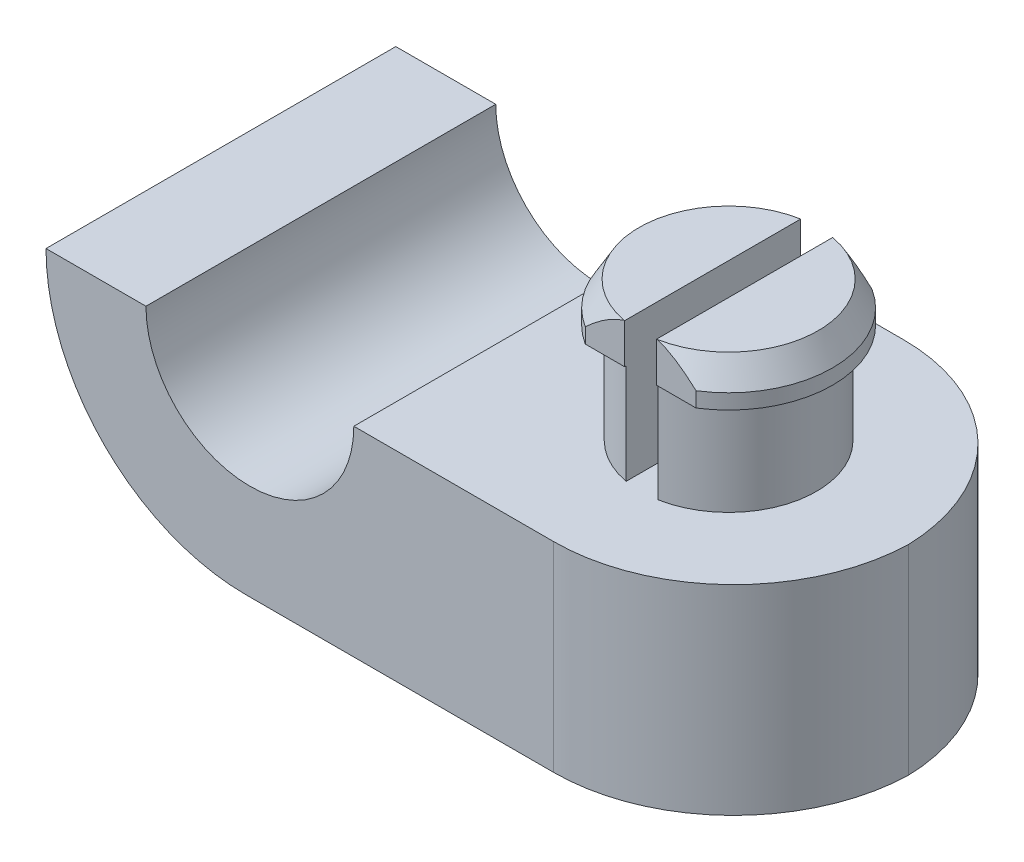
ISO-10303-21;
HEADER;
FILE_DESCRIPTION(('STEP AP214'),'2;1');
FILE_NAME('part.step','',(''),(''),'','','');
FILE_SCHEMA(('AUTOMOTIVE_DESIGN { 1 0 10303 214 1 1 1 1 }'));
ENDSEC;
DATA;
#1=APPLICATION_CONTEXT('core data for automotive mechanical design processes');
#2=APPLICATION_PROTOCOL_DEFINITION('international standard','automotive_design',2000,#1);
#3=PRODUCT_CONTEXT('',#1,'mechanical');
#4=PRODUCT('Part','Part','',(#3));
#5=PRODUCT_RELATED_PRODUCT_CATEGORY('part','',(#4));
#6=PRODUCT_DEFINITION_FORMATION('','',#4);
#7=PRODUCT_DEFINITION_CONTEXT('part definition',#1,'design');
#8=PRODUCT_DEFINITION('design','',#6,#7);
#9=PRODUCT_DEFINITION_SHAPE('','',#8);
#10=(LENGTH_UNIT() NAMED_UNIT(*) SI_UNIT(.MILLI.,.METRE.));
#11=(NAMED_UNIT(*) PLANE_ANGLE_UNIT() SI_UNIT($,.RADIAN.));
#12=(NAMED_UNIT(*) SI_UNIT($,.STERADIAN.) SOLID_ANGLE_UNIT());
#13=UNCERTAINTY_MEASURE_WITH_UNIT(LENGTH_MEASURE(1.E-05),#10,'distance_accuracy_value','');
#14=(GEOMETRIC_REPRESENTATION_CONTEXT(3) GLOBAL_UNCERTAINTY_ASSIGNED_CONTEXT((#13)) GLOBAL_UNIT_ASSIGNED_CONTEXT((#10,
#11,#12)) REPRESENTATION_CONTEXT('',''));
#15=CARTESIAN_POINT('',(0.,0.,0.));
#16=DIRECTION('',(0.,0.,1.));
#17=DIRECTION('',(1.,0.,0.));
#18=AXIS2_PLACEMENT_3D('',#15,#16,#17);
#19=CARTESIAN_POINT('',(9.652,3.175,5.55625));
#20=DIRECTION('',(0.,-1.,0.));
#21=DIRECTION('',(0.,0.,-1.));
#22=AXIS2_PLACEMENT_3D('',#19,#20,#21);
#23=CYLINDRICAL_SURFACE('',#22,2.794);
#24=DIRECTION('',(0.,-1.,0.));
#25=VECTOR('',#24,1.);
#26=CARTESIAN_POINT('',(9.144,3.175,8.30368007190356));
#27=LINE('',#26,#25);
#28=CARTESIAN_POINT('',(9.144,3.175,8.30368007190356));
#29=VERTEX_POINT('',#28);
#30=CARTESIAN_POINT('',(9.144,0.,8.30368007190356));
#31=VERTEX_POINT('',#30);
#32=EDGE_CURVE('E231',#29,#31,#27,.T.);
#33=ORIENTED_EDGE('',*,*,#32,.F.);
#34=CARTESIAN_POINT('',(9.652,3.175,5.55625));
#35=DIRECTION('',(0.,1.,0.));
#36=DIRECTION('',(0.,0.,1.));
#37=AXIS2_PLACEMENT_3D('',#34,#35,#36);
#38=CIRCLE('',#37,2.794);
#39=CARTESIAN_POINT('',(9.144,3.175,2.80881992809644));
#40=VERTEX_POINT('',#39);
#41=EDGE_CURVE('E260',#40,#29,#38,.T.);
#42=ORIENTED_EDGE('',*,*,#41,.F.);
#43=DIRECTION('',(0.,-1.,0.));
#44=VECTOR('',#43,1.);
#45=CARTESIAN_POINT('',(9.144,3.175,2.80881992809644));
#46=LINE('',#45,#44);
#47=CARTESIAN_POINT('',(9.144,0.,2.80881992809644));
#48=VERTEX_POINT('',#47);
#49=EDGE_CURVE('E226',#48,#40,#46,.F.);
#50=ORIENTED_EDGE('',*,*,#49,.F.);
#51=CARTESIAN_POINT('',(9.652,0.,5.55625));
#52=DIRECTION('',(0.,1.,0.));
#53=DIRECTION('',(0.,0.,1.));
#54=AXIS2_PLACEMENT_3D('',#51,#52,#53);
#55=CIRCLE('',#54,2.794);
#56=EDGE_CURVE('E255',#48,#31,#55,.T.);
#57=ORIENTED_EDGE('',*,*,#56,.T.);
#58=EDGE_LOOP('',(#33,#42,#50,#57));
#59=FACE_BOUND('',#58,.T.);
#60=ADVANCED_FACE('F35',(#59),#23,.T.);
#61=DIRECTION('',(0.,-1.,0.));
#62=VECTOR('',#61,1.);
#63=CARTESIAN_POINT('',(10.16,3.175,2.80881992809644));
#64=LINE('',#63,#62);
#65=CARTESIAN_POINT('',(10.16,3.175,2.80881992809644));
#66=VERTEX_POINT('',#65);
#67=CARTESIAN_POINT('',(10.16,0.,2.80881992809644));
#68=VERTEX_POINT('',#67);
#69=EDGE_CURVE('E211',#66,#68,#64,.T.);
#70=ORIENTED_EDGE('',*,*,#69,.F.);
#71=CARTESIAN_POINT('',(10.16,3.175,8.30368007190356));
#72=VERTEX_POINT('',#71);
#73=EDGE_CURVE('E256',#72,#66,#38,.T.);
#74=ORIENTED_EDGE('',*,*,#73,.F.);
#75=DIRECTION('',(0.,-1.,0.));
#76=VECTOR('',#75,1.);
#77=CARTESIAN_POINT('',(10.16,3.175,8.30368007190356));
#78=LINE('',#77,#76);
#79=CARTESIAN_POINT('',(10.16,0.,8.30368007190356));
#80=VERTEX_POINT('',#79);
#81=EDGE_CURVE('E220',#80,#72,#78,.F.);
#82=ORIENTED_EDGE('',*,*,#81,.F.);
#83=EDGE_CURVE('E261',#80,#68,#55,.T.);
#84=ORIENTED_EDGE('',*,*,#83,.T.);
#85=EDGE_LOOP('',(#70,#74,#82,#84));
#86=FACE_BOUND('',#85,.T.);
#87=ADVANCED_FACE('F381',(#86),#23,.T.);
#88=CARTESIAN_POINT('',(9.652,3.175,5.55625));
#89=DIRECTION('',(0.,1.,0.));
#90=DIRECTION('',(0.,0.,1.));
#91=AXIS2_PLACEMENT_3D('',#88,#89,#90);
#92=PLANE('',#91);
#93=DIRECTION('',(0.,0.,1.));
#94=VECTOR('',#93,1.);
#95=CARTESIAN_POINT('',(10.16,3.175,5.55625));
#96=LINE('',#95,#94);
#97=CARTESIAN_POINT('',(10.16,3.175,2.76225));
#98=VERTEX_POINT('',#97);
#99=EDGE_CURVE('E208',#98,#66,#96,.T.);
#100=ORIENTED_EDGE('',*,*,#99,.F.);
#101=DIRECTION('',(-1.,0.,0.));
#102=VECTOR('',#101,1.);
#103=CARTESIAN_POINT('',(7.89223637951002,3.175,2.76225));
#104=LINE('',#103,#102);
#105=CARTESIAN_POINT('',(11.41176362049,3.175,2.76225));
#106=VERTEX_POINT('',#105);
#107=EDGE_CURVE('E207',#106,#98,#104,.T.);
#108=ORIENTED_EDGE('',*,*,#107,.F.);
#109=CARTESIAN_POINT('',(9.652,3.175,5.55625));
#110=DIRECTION('',(0.,1.,0.));
#111=DIRECTION('',(0.,0.,1.));
#112=AXIS2_PLACEMENT_3D('',#109,#110,#111);
#113=CIRCLE('',#112,3.302);
#114=CARTESIAN_POINT('',(11.41176362049,3.175,8.35025));
#115=VERTEX_POINT('',#114);
#116=EDGE_CURVE('E243',#115,#106,#113,.T.);
#117=ORIENTED_EDGE('',*,*,#116,.F.);
#118=DIRECTION('',(1.,0.,0.));
#119=VECTOR('',#118,1.);
#120=CARTESIAN_POINT('',(7.89223637951002,3.175,8.35025));
#121=LINE('',#120,#119);
#122=CARTESIAN_POINT('',(10.16,3.175,8.35025));
#123=VERTEX_POINT('',#122);
#124=EDGE_CURVE('E239',#123,#115,#121,.T.);
#125=ORIENTED_EDGE('',*,*,#124,.F.);
#126=EDGE_CURVE('E213',#72,#123,#96,.T.);
#127=ORIENTED_EDGE('',*,*,#126,.F.);
#128=ORIENTED_EDGE('',*,*,#73,.T.);
#129=EDGE_LOOP('',(#100,#108,#117,#125,#127,#128));
#130=FACE_BOUND('',#129,.T.);
#131=ADVANCED_FACE('F336',(#130),#92,.F.);
#132=DIRECTION('',(0.,0.,-1.));
#133=VECTOR('',#132,1.);
#134=CARTESIAN_POINT('',(9.144,3.175,5.55625));
#135=LINE('',#134,#133);
#136=CARTESIAN_POINT('',(9.144,3.175,8.35025));
#137=VERTEX_POINT('',#136);
#138=EDGE_CURVE('E227',#137,#29,#135,.T.);
#139=ORIENTED_EDGE('',*,*,#138,.F.);
#140=CARTESIAN_POINT('',(7.89223637951002,3.175,8.35025));
#141=VERTEX_POINT('',#140);
#142=EDGE_CURVE('E240',#141,#137,#121,.T.);
#143=ORIENTED_EDGE('',*,*,#142,.F.);
#144=CARTESIAN_POINT('',(9.652,3.175,5.55625));
#145=DIRECTION('',(0.,1.,0.));
#146=DIRECTION('',(0.,0.,1.));
#147=AXIS2_PLACEMENT_3D('',#144,#145,#146);
#148=CIRCLE('',#147,3.302);
#149=CARTESIAN_POINT('',(7.89223637951002,3.175,2.76225));
#150=VERTEX_POINT('',#149);
#151=EDGE_CURVE('E233',#150,#141,#148,.T.);
#152=ORIENTED_EDGE('',*,*,#151,.F.);
#153=CARTESIAN_POINT('',(9.144,3.175,2.76225));
#154=VERTEX_POINT('',#153);
#155=EDGE_CURVE('E246',#154,#150,#104,.T.);
#156=ORIENTED_EDGE('',*,*,#155,.F.);
#157=EDGE_CURVE('E224',#40,#154,#135,.T.);
#158=ORIENTED_EDGE('',*,*,#157,.F.);
#159=ORIENTED_EDGE('',*,*,#41,.T.);
#160=EDGE_LOOP('',(#139,#143,#152,#156,#158,#159));
#161=FACE_BOUND('',#160,.T.);
#162=ADVANCED_FACE('F349',(#161),#92,.F.);
#163=CARTESIAN_POINT('',(7.89223637951002,4.445,8.35025));
#164=DIRECTION('',(0.,0.,-1.));
#165=DIRECTION('',(-1.,0.,0.));
#166=AXIS2_PLACEMENT_3D('',#163,#164,#165);
#167=PLANE('',#166);
#168=DIRECTION('',(1.,0.,0.));
#169=VECTOR('',#168,1.);
#170=CARTESIAN_POINT('',(7.89223637951002,4.445,8.35025));
#171=LINE('',#170,#169);
#172=CARTESIAN_POINT('',(9.12251514562598,4.445,8.35025));
#173=VERTEX_POINT('',#172);
#174=CARTESIAN_POINT('',(9.144,4.445,8.35025));
#175=VERTEX_POINT('',#174);
#176=EDGE_CURVE('E234',#173,#175,#171,.T.);
#177=ORIENTED_EDGE('',*,*,#176,.F.);
#178=CARTESIAN_POINT('',(9.12251514562599,4.445,8.35025));
#179=CARTESIAN_POINT('',(9.04475929325533,4.41990563455317,8.35025));
#180=CARTESIAN_POINT('',(8.96873666780904,4.39007238997305,8.35025));
#181=CARTESIAN_POINT('',(8.82040231472255,4.32284826987968,8.35025));
#182=CARTESIAN_POINT('',(8.74807841198133,4.28548450071081,8.35025));
#183=CARTESIAN_POINT('',(8.60770768822331,4.20541355427589,8.35025));
#184=CARTESIAN_POINT('',(8.53961909929552,4.16277800900343,8.35025));
#185=CARTESIAN_POINT('',(8.40638043302648,4.07305674868423,8.35025));
#186=CARTESIAN_POINT('',(8.34123281275837,4.02596741070956,8.35025));
#187=CARTESIAN_POINT('',(8.21079776816959,3.92624191278314,8.35025));
#188=CARTESIAN_POINT('',(8.14562796166965,3.87345346010828,8.35025));
#189=CARTESIAN_POINT('',(8.01735170560367,3.76457083678296,8.35025));
#190=CARTESIAN_POINT('',(7.95426192373615,3.70845696037162,8.35025));
#191=CARTESIAN_POINT('',(7.89223637951002,3.65124999999999,8.35025));
#192=B_SPLINE_CURVE_WITH_KNOTS('',3,(#178,#179,#180,#181,#182,#183,#184,#185,#186,#187,#188,
#189,#190,#191),.UNSPECIFIED.,.F.,.F.,(4,2,2,2,2,2,4),(0.,0.244681358968621,0.488497223943545,
0.729304216410352,0.970308805679508,1.22181555042136,1.47500034036548),.UNSPECIFIED.);
#193=CARTESIAN_POINT('',(7.89223637951002,3.65124999999999,8.35025));
#194=VERTEX_POINT('',#193);
#195=EDGE_CURVE('E62',#173,#194,#192,.T.);
#196=ORIENTED_EDGE('',*,*,#195,.T.);
#197=DIRECTION('',(0.,-1.,0.));
#198=VECTOR('',#197,1.);
#199=CARTESIAN_POINT('',(7.89223637951002,4.445,8.35025));
#200=LINE('',#199,#198);
#201=EDGE_CURVE('E253',#194,#141,#200,.T.);
#202=ORIENTED_EDGE('',*,*,#201,.T.);
#203=ORIENTED_EDGE('',*,*,#142,.T.);
#204=DIRECTION('',(0.,-1.,0.));
#205=VECTOR('',#204,1.);
#206=CARTESIAN_POINT('',(9.144,4.445,8.35025));
#207=LINE('',#206,#205);
#208=EDGE_CURVE('E229',#175,#137,#207,.T.);
#209=ORIENTED_EDGE('',*,*,#208,.F.);
#210=EDGE_LOOP('',(#177,#196,#202,#203,#209));
#211=FACE_BOUND('',#210,.T.);
#212=ADVANCED_FACE('F345',(#211),#167,.F.);
#213=DIRECTION('',(0.,-1.,0.));
#214=VECTOR('',#213,1.);
#215=CARTESIAN_POINT('',(11.41176362049,4.445,8.35025));
#216=LINE('',#215,#214);
#217=CARTESIAN_POINT('',(11.41176362049,3.65124999999999,8.35025));
#218=VERTEX_POINT('',#217);
#219=EDGE_CURVE('E251',#218,#115,#216,.T.);
#220=ORIENTED_EDGE('',*,*,#219,.F.);
#221=CARTESIAN_POINT('',(11.41176362049,3.65124999999999,8.35025));
#222=CARTESIAN_POINT('',(11.3408351929134,3.71663889948708,8.35025));
#223=CARTESIAN_POINT('',(11.2685168144737,3.78063807281625,8.35025));
#224=CARTESIAN_POINT('',(11.12013565491,3.90489820889516,8.35025));
#225=CARTESIAN_POINT('',(11.0440559546576,3.96513887325871,8.35025));
#226=CARTESIAN_POINT('',(10.8896533873198,4.07894027896918,8.35025));
#227=CARTESIAN_POINT('',(10.8114203294183,4.13262139551544,8.35025));
#228=CARTESIAN_POINT('',(10.6506925115505,4.23291033743425,8.35025));
#229=CARTESIAN_POINT('',(10.5682075739385,4.27953356507681,8.35025));
#230=CARTESIAN_POINT('',(10.4347432506512,4.34545760821125,8.35025));
#231=CARTESIAN_POINT('',(10.3853335911521,4.3679297139674,8.35025));
#232=CARTESIAN_POINT('',(10.2846983490377,4.40933162480823,8.35025));
#233=CARTESIAN_POINT('',(10.2334633733887,4.42823849690594,8.35025));
#234=CARTESIAN_POINT('',(10.181484854374,4.445,8.35025));
#235=B_SPLINE_CURVE_WITH_KNOTS('',3,(#221,#222,#223,#224,#225,#226,#227,#228,#229,#230,#231,
#232,#233,#234),.UNSPECIFIED.,.F.,.F.,(4,2,2,2,2,2,4),(0.,0.289514113222375,0.580476283289387,
0.864849650662834,1.14859320168029,1.31130079074107,1.47502171801344),.UNSPECIFIED.);
#236=CARTESIAN_POINT('',(10.181484854374,4.445,8.35025));
#237=VERTEX_POINT('',#236);
#238=EDGE_CURVE('E352',#218,#237,#235,.T.);
#239=ORIENTED_EDGE('',*,*,#238,.T.);
#240=CARTESIAN_POINT('',(10.16,4.445,8.35025));
#241=VERTEX_POINT('',#240);
#242=EDGE_CURVE('E235',#241,#237,#171,.T.);
#243=ORIENTED_EDGE('',*,*,#242,.F.);
#244=DIRECTION('',(0.,1.,0.));
#245=VECTOR('',#244,1.);
#246=CARTESIAN_POINT('',(10.16,4.445,8.35025));
#247=LINE('',#246,#245);
#248=EDGE_CURVE('E200',#123,#241,#247,.T.);
#249=ORIENTED_EDGE('',*,*,#248,.F.);
#250=ORIENTED_EDGE('',*,*,#124,.T.);
#251=EDGE_LOOP('',(#220,#239,#243,#249,#250));
#252=FACE_BOUND('',#251,.T.);
#253=ADVANCED_FACE('F334',(#252),#167,.F.);
#254=CARTESIAN_POINT('',(7.89223637951002,4.445,2.76225));
#255=DIRECTION('',(0.,0.,1.));
#256=DIRECTION('',(1.,0.,0.));
#257=AXIS2_PLACEMENT_3D('',#254,#255,#256);
#258=PLANE('',#257);
#259=DIRECTION('',(0.,-1.,0.));
#260=VECTOR('',#259,1.);
#261=CARTESIAN_POINT('',(7.89223637951002,4.445,2.76225));
#262=LINE('',#261,#260);
#263=CARTESIAN_POINT('',(7.89223637951002,3.65124999999999,2.76225));
#264=VERTEX_POINT('',#263);
#265=EDGE_CURVE('E192',#264,#150,#262,.T.);
#266=ORIENTED_EDGE('',*,*,#265,.F.);
#267=CARTESIAN_POINT('',(7.89223637951002,3.65124999999999,2.76225));
#268=CARTESIAN_POINT('',(7.96316480708663,3.71663889948708,2.76225));
#269=CARTESIAN_POINT('',(8.0354831855263,3.78063807281624,2.76225));
#270=CARTESIAN_POINT('',(8.18386434509003,3.90489820889516,2.76225));
#271=CARTESIAN_POINT('',(8.2599440453424,3.9651388732587,2.76225));
#272=CARTESIAN_POINT('',(8.41434661268016,4.07894027896917,2.76225));
#273=CARTESIAN_POINT('',(8.49257967058173,4.13262139551544,2.76225));
#274=CARTESIAN_POINT('',(8.65330748844948,4.23291033743424,2.76225));
#275=CARTESIAN_POINT('',(8.73579242606153,4.2795335650768,2.76225));
#276=CARTESIAN_POINT('',(8.86925674934883,4.34545760821124,2.76225));
#277=CARTESIAN_POINT('',(8.91866640884791,4.3679297139674,2.76225));
#278=CARTESIAN_POINT('',(9.01930165096227,4.40933162480823,2.76225));
#279=CARTESIAN_POINT('',(9.0705366266113,4.42823849690594,2.76225));
#280=CARTESIAN_POINT('',(9.12251514562599,4.445,2.76225));
#281=B_SPLINE_CURVE_WITH_KNOTS('',3,(#267,#268,#269,#270,#271,#272,#273,#274,#275,#276,#277,
#278,#279,#280),.UNSPECIFIED.,.F.,.F.,(4,2,2,2,2,2,4),(0.,0.289514113222374,0.580476283289382,
0.864849650662826,1.14859320168028,1.31130079074107,1.47502171801346),.UNSPECIFIED.);
#282=CARTESIAN_POINT('',(9.12251514562599,4.445,2.76225));
#283=VERTEX_POINT('',#282);
#284=EDGE_CURVE('E11',#264,#283,#281,.T.);
#285=ORIENTED_EDGE('',*,*,#284,.T.);
#286=DIRECTION('',(-1.,0.,0.));
#287=VECTOR('',#286,1.);
#288=CARTESIAN_POINT('',(7.89223637951002,4.445,2.76225));
#289=LINE('',#288,#287);
#290=CARTESIAN_POINT('',(9.144,4.445,2.76225));
#291=VERTEX_POINT('',#290);
#292=EDGE_CURVE('E193',#291,#283,#289,.T.);
#293=ORIENTED_EDGE('',*,*,#292,.F.);
#294=DIRECTION('',(0.,1.,0.));
#295=VECTOR('',#294,1.);
#296=CARTESIAN_POINT('',(9.144,4.445,2.76225));
#297=LINE('',#296,#295);
#298=EDGE_CURVE('E222',#154,#291,#297,.T.);
#299=ORIENTED_EDGE('',*,*,#298,.F.);
#300=ORIENTED_EDGE('',*,*,#155,.T.);
#301=EDGE_LOOP('',(#266,#285,#293,#299,#300));
#302=FACE_BOUND('',#301,.T.);
#303=ADVANCED_FACE('F329',(#302),#258,.F.);
#304=CARTESIAN_POINT('',(10.181484854374,4.445,2.76225));
#305=VERTEX_POINT('',#304);
#306=CARTESIAN_POINT('',(10.16,4.445,2.76225));
#307=VERTEX_POINT('',#306);
#308=EDGE_CURVE('E182',#305,#307,#289,.T.);
#309=ORIENTED_EDGE('',*,*,#308,.F.);
#310=CARTESIAN_POINT('',(10.181484854374,4.445,2.76225));
#311=CARTESIAN_POINT('',(10.2592407067447,4.41990563455317,2.76225));
#312=CARTESIAN_POINT('',(10.335263332191,4.39007238997305,2.76225));
#313=CARTESIAN_POINT('',(10.4835976852775,4.32284826987968,2.76225));
#314=CARTESIAN_POINT('',(10.5559215880187,4.28548450071081,2.76225));
#315=CARTESIAN_POINT('',(10.6962923117767,4.20541355427589,2.76225));
#316=CARTESIAN_POINT('',(10.7643809007045,4.16277800900342,2.76225));
#317=CARTESIAN_POINT('',(10.8976195669735,4.07305674868423,2.76225));
#318=CARTESIAN_POINT('',(10.9627671872416,4.02596741070955,2.76225));
#319=CARTESIAN_POINT('',(11.0932022318304,3.92624191278313,2.76225));
#320=CARTESIAN_POINT('',(11.1583720383304,3.87345346010827,2.76225));
#321=CARTESIAN_POINT('',(11.2866482943963,3.76457083678296,2.76225));
#322=CARTESIAN_POINT('',(11.3497380762639,3.70845696037162,2.76225));
#323=CARTESIAN_POINT('',(11.41176362049,3.65124999999999,2.76225));
#324=B_SPLINE_CURVE_WITH_KNOTS('',3,(#310,#311,#312,#313,#314,#315,#316,#317,#318,#319,#320,
#321,#322,#323),.UNSPECIFIED.,.F.,.F.,(4,2,2,2,2,2,4),(0.,0.24468135896862,0.488497223943544,
0.729304216410351,0.970308805679509,1.22181555042135,1.47500034036547),.UNSPECIFIED.);
#325=CARTESIAN_POINT('',(11.41176362049,3.65124999999999,2.76225));
#326=VERTEX_POINT('',#325);
#327=EDGE_CURVE('E319',#305,#326,#324,.T.);
#328=ORIENTED_EDGE('',*,*,#327,.T.);
#329=DIRECTION('',(0.,-1.,0.));
#330=VECTOR('',#329,1.);
#331=CARTESIAN_POINT('',(11.41176362049,4.445,2.76225));
#332=LINE('',#331,#330);
#333=EDGE_CURVE('E249',#326,#106,#332,.T.);
#334=ORIENTED_EDGE('',*,*,#333,.T.);
#335=ORIENTED_EDGE('',*,*,#107,.T.);
#336=DIRECTION('',(0.,-1.,0.));
#337=VECTOR('',#336,1.);
#338=CARTESIAN_POINT('',(10.16,4.445,2.76225));
#339=LINE('',#338,#337);
#340=EDGE_CURVE('E197',#307,#98,#339,.T.);
#341=ORIENTED_EDGE('',*,*,#340,.F.);
#342=EDGE_LOOP('',(#309,#328,#334,#335,#341));
#343=FACE_BOUND('',#342,.T.);
#344=ADVANCED_FACE('F205',(#343),#258,.F.);
#345=CARTESIAN_POINT('',(9.652,4.445,5.55625));
#346=DIRECTION('',(0.,1.,0.));
#347=DIRECTION('',(0.,0.,1.));
#348=AXIS2_PLACEMENT_3D('',#345,#346,#347);
#349=PLANE('',#348);
#350=ORIENTED_EDGE('',*,*,#292,.T.);
#351=CARTESIAN_POINT('',(9.652,4.445,5.55625));
#352=DIRECTION('',(0.,1.,0.));
#353=DIRECTION('',(0.,0.,1.));
#354=AXIS2_PLACEMENT_3D('',#351,#352,#353);
#355=CIRCLE('',#354,2.84372822383073);
#356=EDGE_CURVE('E361',#283,#173,#355,.T.);
#357=ORIENTED_EDGE('',*,*,#356,.T.);
#358=ORIENTED_EDGE('',*,*,#176,.T.);
#359=DIRECTION('',(0.,0.,-1.));
#360=VECTOR('',#359,1.);
#361=CARTESIAN_POINT('',(9.144,4.445,5.55625));
#362=LINE('',#361,#360);
#363=EDGE_CURVE('E201',#175,#291,#362,.T.);
#364=ORIENTED_EDGE('',*,*,#363,.T.);
#365=EDGE_LOOP('',(#350,#357,#358,#364));
#366=FACE_BOUND('',#365,.T.);
#367=ADVANCED_FACE('F448',(#366),#349,.T.);
#368=ORIENTED_EDGE('',*,*,#242,.T.);
#369=CARTESIAN_POINT('',(9.652,4.445,5.55625));
#370=DIRECTION('',(0.,1.,0.));
#371=DIRECTION('',(0.,0.,1.));
#372=AXIS2_PLACEMENT_3D('',#369,#370,#371);
#373=CIRCLE('',#372,2.84372822383073);
#374=EDGE_CURVE('E189',#237,#305,#373,.T.);
#375=ORIENTED_EDGE('',*,*,#374,.T.);
#376=ORIENTED_EDGE('',*,*,#308,.T.);
#377=DIRECTION('',(0.,0.,1.));
#378=VECTOR('',#377,1.);
#379=CARTESIAN_POINT('',(10.16,4.445,5.55625));
#380=LINE('',#379,#378);
#381=EDGE_CURVE('E186',#307,#241,#380,.T.);
#382=ORIENTED_EDGE('',*,*,#381,.T.);
#383=EDGE_LOOP('',(#368,#375,#376,#382));
#384=FACE_BOUND('',#383,.T.);
#385=ADVANCED_FACE('F185',(#384),#349,.T.);
#386=CARTESIAN_POINT('',(-6.477,0.,11.1125));
#387=DIRECTION('',(0.,1.,0.));
#388=DIRECTION('',(0.,0.,1.));
#389=AXIS2_PLACEMENT_3D('',#386,#387,#388);
#390=PLANE('',#389);
#391=DIRECTION('',(1.,0.,0.));
#392=VECTOR('',#391,1.);
#393=CARTESIAN_POINT('',(-6.477,0.,0.));
#394=LINE('',#393,#392);
#395=CARTESIAN_POINT('',(-6.477,0.,0.));
#396=VERTEX_POINT('',#395);
#397=CARTESIAN_POINT('',(-3.302,0.,0.));
#398=VERTEX_POINT('',#397);
#399=EDGE_CURVE('E277',#396,#398,#394,.T.);
#400=ORIENTED_EDGE('',*,*,#399,.F.);
#401=DIRECTION('',(0.,0.,-1.));
#402=VECTOR('',#401,1.);
#403=CARTESIAN_POINT('',(-6.477,0.,11.1125));
#404=LINE('',#403,#402);
#405=CARTESIAN_POINT('',(-6.477,0.,11.1125));
#406=VERTEX_POINT('',#405);
#407=EDGE_CURVE('E287',#406,#396,#404,.T.);
#408=ORIENTED_EDGE('',*,*,#407,.F.);
#409=DIRECTION('',(1.,0.,0.));
#410=VECTOR('',#409,1.);
#411=CARTESIAN_POINT('',(-6.477,0.,11.1125));
#412=LINE('',#411,#410);
#413=CARTESIAN_POINT('',(-3.302,0.,11.1125));
#414=VERTEX_POINT('',#413);
#415=EDGE_CURVE('E264',#406,#414,#412,.T.);
#416=ORIENTED_EDGE('',*,*,#415,.T.);
#417=DIRECTION('',(0.,0.,-1.));
#418=VECTOR('',#417,1.);
#419=CARTESIAN_POINT('',(-3.302,0.,11.1125));
#420=LINE('',#419,#418);
#421=EDGE_CURVE('E276',#414,#398,#420,.T.);
#422=ORIENTED_EDGE('',*,*,#421,.T.);
#423=EDGE_LOOP('',(#400,#408,#416,#422));
#424=FACE_BOUND('',#423,.T.);
#425=ADVANCED_FACE('F411',(#424),#390,.T.);
#426=CARTESIAN_POINT('',(-6.477,-6.35,11.1125));
#427=DIRECTION('',(0.,1.,0.));
#428=DIRECTION('',(0.,0.,1.));
#429=AXIS2_PLACEMENT_3D('',#426,#427,#428);
#430=PLANE('',#429);
#431=DIRECTION('',(1.,0.,0.));
#432=VECTOR('',#431,1.);
#433=CARTESIAN_POINT('',(-6.477,-6.35,0.));
#434=LINE('',#433,#432);
#435=CARTESIAN_POINT('',(-0.127,-6.35,0.));
#436=VERTEX_POINT('',#435);
#437=CARTESIAN_POINT('',(9.652,-6.35,0.));
#438=VERTEX_POINT('',#437);
#439=EDGE_CURVE('E268',#436,#438,#434,.T.);
#440=ORIENTED_EDGE('',*,*,#439,.T.);
#441=CARTESIAN_POINT('',(9.652,-6.35,5.715));
#442=DIRECTION('',(0.,1.,0.));
#443=DIRECTION('',(0.,0.,1.));
#444=AXIS2_PLACEMENT_3D('',#441,#442,#443);
#445=CIRCLE('',#444,5.715);
#446=CARTESIAN_POINT('',(15.3647947134043,-6.35,5.55625));
#447=VERTEX_POINT('',#446);
#448=EDGE_CURVE('E305',#438,#447,#445,.F.);
#449=ORIENTED_EDGE('',*,*,#448,.T.);
#450=CARTESIAN_POINT('',(9.652,-6.35,5.3975));
#451=DIRECTION('',(0.,1.,0.));
#452=DIRECTION('',(0.,0.,1.));
#453=AXIS2_PLACEMENT_3D('',#450,#451,#452);
#454=CIRCLE('',#453,5.715);
#455=CARTESIAN_POINT('',(9.652,-6.35,11.1125));
#456=VERTEX_POINT('',#455);
#457=EDGE_CURVE('E303',#447,#456,#454,.F.);
#458=ORIENTED_EDGE('',*,*,#457,.T.);
#459=DIRECTION('',(1.,0.,0.));
#460=VECTOR('',#459,1.);
#461=CARTESIAN_POINT('',(-6.477,-6.35,11.1125));
#462=LINE('',#461,#460);
#463=CARTESIAN_POINT('',(-0.127,-6.35,11.1125));
#464=VERTEX_POINT('',#463);
#465=EDGE_CURVE('E273',#464,#456,#462,.T.);
#466=ORIENTED_EDGE('',*,*,#465,.F.);
#467=DIRECTION('',(0.,0.,-1.));
#468=VECTOR('',#467,1.);
#469=CARTESIAN_POINT('',(-0.127,-6.35,11.1125));
#470=LINE('',#469,#468);
#471=EDGE_CURVE('E290',#464,#436,#470,.T.);
#472=ORIENTED_EDGE('',*,*,#471,.T.);
#473=EDGE_LOOP('',(#440,#449,#458,#466,#472));
#474=FACE_BOUND('',#473,.T.);
#475=ADVANCED_FACE('F389',(#474),#430,.F.);
#476=CARTESIAN_POINT('',(3.302,0.,11.1125));
#477=DIRECTION('',(0.,1.,0.));
#478=DIRECTION('',(0.,0.,1.));
#479=AXIS2_PLACEMENT_3D('',#476,#477,#478);
#480=PLANE('',#479);
#481=DIRECTION('',(0.,0.,-1.));
#482=VECTOR('',#481,1.);
#483=CARTESIAN_POINT('',(9.144,0.,11.1125));
#484=LINE('',#483,#482);
#485=EDGE_CURVE('E209',#31,#48,#484,.T.);
#486=ORIENTED_EDGE('',*,*,#485,.F.);
#487=ORIENTED_EDGE('',*,*,#56,.F.);
#488=EDGE_LOOP('',(#486,#487));
#489=FACE_BOUND('',#488,.T.);
#490=DIRECTION('',(0.,0.,-1.));
#491=VECTOR('',#490,1.);
#492=CARTESIAN_POINT('',(10.16,0.,11.1125));
#493=LINE('',#492,#491);
#494=EDGE_CURVE('E214',#80,#68,#493,.T.);
#495=ORIENTED_EDGE('',*,*,#494,.T.);
#496=ORIENTED_EDGE('',*,*,#83,.F.);
#497=EDGE_LOOP('',(#495,#496));
#498=FACE_BOUND('',#497,.T.);
#499=CARTESIAN_POINT('',(9.652,0.,5.715));
#500=DIRECTION('',(0.,1.,0.));
#501=DIRECTION('',(0.,0.,1.));
#502=AXIS2_PLACEMENT_3D('',#499,#500,#501);
#503=CIRCLE('',#502,5.715);
#504=CARTESIAN_POINT('',(15.3647947134043,0.,5.55625));
#505=VERTEX_POINT('',#504);
#506=CARTESIAN_POINT('',(9.652,0.,0.));
#507=VERTEX_POINT('',#506);
#508=EDGE_CURVE('E309',#505,#507,#503,.T.);
#509=ORIENTED_EDGE('',*,*,#508,.T.);
#510=DIRECTION('',(1.,0.,0.));
#511=VECTOR('',#510,1.);
#512=CARTESIAN_POINT('',(3.302,0.,0.));
#513=LINE('',#512,#511);
#514=CARTESIAN_POINT('',(3.302,0.,0.));
#515=VERTEX_POINT('',#514);
#516=EDGE_CURVE('E283',#515,#507,#513,.T.);
#517=ORIENTED_EDGE('',*,*,#516,.F.);
#518=DIRECTION('',(0.,0.,-1.));
#519=VECTOR('',#518,1.);
#520=CARTESIAN_POINT('',(3.302,0.,11.1125));
#521=LINE('',#520,#519);
#522=CARTESIAN_POINT('',(3.302,0.,11.1125));
#523=VERTEX_POINT('',#522);
#524=EDGE_CURVE('E291',#523,#515,#521,.T.);
#525=ORIENTED_EDGE('',*,*,#524,.F.);
#526=DIRECTION('',(1.,0.,0.));
#527=VECTOR('',#526,1.);
#528=CARTESIAN_POINT('',(3.302,0.,11.1125));
#529=LINE('',#528,#527);
#530=CARTESIAN_POINT('',(9.652,0.,11.1125));
#531=VERTEX_POINT('',#530);
#532=EDGE_CURVE('E271',#523,#531,#529,.T.);
#533=ORIENTED_EDGE('',*,*,#532,.T.);
#534=CARTESIAN_POINT('',(9.652,0.,5.3975));
#535=DIRECTION('',(0.,1.,0.));
#536=DIRECTION('',(0.,0.,1.));
#537=AXIS2_PLACEMENT_3D('',#534,#535,#536);
#538=CIRCLE('',#537,5.715);
#539=EDGE_CURVE('E307',#531,#505,#538,.T.);
#540=ORIENTED_EDGE('',*,*,#539,.T.);
#541=EDGE_LOOP('',(#509,#517,#525,#533,#540));
#542=FACE_BOUND('',#541,.T.);
#543=ADVANCED_FACE('F385',(#489,#498,#542),#480,.T.);
#544=CARTESIAN_POINT('',(0.,0.,11.1125));
#545=DIRECTION('',(0.,0.,-1.));
#546=DIRECTION('',(-1.,0.,0.));
#547=AXIS2_PLACEMENT_3D('',#544,#545,#546);
#548=CYLINDRICAL_SURFACE('',#547,3.302);
#549=CARTESIAN_POINT('',(0.,0.,0.));
#550=DIRECTION('',(0.,0.,1.));
#551=DIRECTION('',(1.,0.,0.));
#552=AXIS2_PLACEMENT_3D('',#549,#550,#551);
#553=CIRCLE('',#552,3.302);
#554=EDGE_CURVE('E280',#398,#515,#553,.T.);
#555=ORIENTED_EDGE('',*,*,#554,.F.);
#556=ORIENTED_EDGE('',*,*,#421,.F.);
#557=CARTESIAN_POINT('',(0.,0.,11.1125));
#558=DIRECTION('',(0.,0.,1.));
#559=DIRECTION('',(1.,0.,0.));
#560=AXIS2_PLACEMENT_3D('',#557,#558,#559);
#561=CIRCLE('',#560,3.302);
#562=EDGE_CURVE('E267',#414,#523,#561,.T.);
#563=ORIENTED_EDGE('',*,*,#562,.T.);
#564=ORIENTED_EDGE('',*,*,#524,.T.);
#565=EDGE_LOOP('',(#555,#556,#563,#564));
#566=FACE_BOUND('',#565,.T.);
#567=ADVANCED_FACE('F388',(#566),#548,.F.);
#568=CARTESIAN_POINT('',(0.,0.,11.1125));
#569=DIRECTION('',(0.,0.,1.));
#570=DIRECTION('',(1.,0.,0.));
#571=AXIS2_PLACEMENT_3D('',#568,#569,#570);
#572=PLANE('',#571);
#573=ORIENTED_EDGE('',*,*,#465,.T.);
#574=DIRECTION('',(0.,-1.,0.));
#575=VECTOR('',#574,1.);
#576=CARTESIAN_POINT('',(9.652,0.,11.1125));
#577=LINE('',#576,#575);
#578=EDGE_CURVE('E202',#456,#531,#577,.F.);
#579=ORIENTED_EDGE('',*,*,#578,.T.);
#580=ORIENTED_EDGE('',*,*,#532,.F.);
#581=ORIENTED_EDGE('',*,*,#562,.F.);
#582=ORIENTED_EDGE('',*,*,#415,.F.);
#583=CARTESIAN_POINT('',(-0.127,0.,11.1125));
#584=DIRECTION('',(0.,0.,1.));
#585=DIRECTION('',(1.,0.,0.));
#586=AXIS2_PLACEMENT_3D('',#583,#584,#585);
#587=CIRCLE('',#586,6.35);
#588=EDGE_CURVE('E298',#406,#464,#587,.T.);
#589=ORIENTED_EDGE('',*,*,#588,.T.);
#590=EDGE_LOOP('',(#573,#579,#580,#581,#582,#589));
#591=FACE_BOUND('',#590,.T.);
#592=ADVANCED_FACE('F418',(#591),#572,.T.);
#593=CARTESIAN_POINT('',(0.,0.,0.));
#594=DIRECTION('',(0.,0.,1.));
#595=DIRECTION('',(1.,0.,0.));
#596=AXIS2_PLACEMENT_3D('',#593,#594,#595);
#597=PLANE('',#596);
#598=ORIENTED_EDGE('',*,*,#516,.T.);
#599=DIRECTION('',(0.,-1.,0.));
#600=VECTOR('',#599,1.);
#601=CARTESIAN_POINT('',(9.652,-6.35,0.));
#602=LINE('',#601,#600);
#603=EDGE_CURVE('E300',#507,#438,#602,.T.);
#604=ORIENTED_EDGE('',*,*,#603,.T.);
#605=ORIENTED_EDGE('',*,*,#439,.F.);
#606=CARTESIAN_POINT('',(-0.127,0.,0.));
#607=DIRECTION('',(0.,0.,1.));
#608=DIRECTION('',(1.,0.,0.));
#609=AXIS2_PLACEMENT_3D('',#606,#607,#608);
#610=CIRCLE('',#609,6.35);
#611=EDGE_CURVE('E296',#436,#396,#610,.F.);
#612=ORIENTED_EDGE('',*,*,#611,.T.);
#613=ORIENTED_EDGE('',*,*,#399,.T.);
#614=ORIENTED_EDGE('',*,*,#554,.T.);
#615=EDGE_LOOP('',(#598,#604,#605,#612,#613,#614));
#616=FACE_BOUND('',#615,.T.);
#617=ADVANCED_FACE('F401',(#616),#597,.F.);
#618=CARTESIAN_POINT('',(-0.127,0.,11.1125));
#619=DIRECTION('',(0.,0.,-1.));
#620=DIRECTION('',(-1.,0.,0.));
#621=AXIS2_PLACEMENT_3D('',#618,#619,#620);
#622=CYLINDRICAL_SURFACE('',#621,6.35);
#623=ORIENTED_EDGE('',*,*,#588,.F.);
#624=ORIENTED_EDGE('',*,*,#407,.T.);
#625=ORIENTED_EDGE('',*,*,#611,.F.);
#626=ORIENTED_EDGE('',*,*,#471,.F.);
#627=EDGE_LOOP('',(#623,#624,#625,#626));
#628=FACE_BOUND('',#627,.T.);
#629=ADVANCED_FACE('F408',(#628),#622,.T.);
#630=CARTESIAN_POINT('',(9.652,0.,5.3975));
#631=DIRECTION('',(0.,-1.,0.));
#632=DIRECTION('',(0.,0.,-1.));
#633=AXIS2_PLACEMENT_3D('',#630,#631,#632);
#634=CYLINDRICAL_SURFACE('',#633,5.715);
#635=DIRECTION('',(0.,-1.,0.));
#636=VECTOR('',#635,1.);
#637=CARTESIAN_POINT('',(15.3647947134043,-3.175,5.55625));
#638=LINE('',#637,#636);
#639=EDGE_CURVE('E259',#505,#447,#638,.T.);
#640=ORIENTED_EDGE('',*,*,#639,.F.);
#641=ORIENTED_EDGE('',*,*,#539,.F.);
#642=ORIENTED_EDGE('',*,*,#578,.F.);
#643=ORIENTED_EDGE('',*,*,#457,.F.);
#644=EDGE_LOOP('',(#640,#641,#642,#643));
#645=FACE_BOUND('',#644,.T.);
#646=ADVANCED_FACE('F421',(#645),#634,.T.);
#647=CARTESIAN_POINT('',(9.652,0.,5.715));
#648=DIRECTION('',(0.,1.,0.));
#649=DIRECTION('',(0.,0.,1.));
#650=AXIS2_PLACEMENT_3D('',#647,#648,#649);
#651=CYLINDRICAL_SURFACE('',#650,5.715);
#652=ORIENTED_EDGE('',*,*,#508,.F.);
#653=ORIENTED_EDGE('',*,*,#639,.T.);
#654=ORIENTED_EDGE('',*,*,#448,.F.);
#655=ORIENTED_EDGE('',*,*,#603,.F.);
#656=EDGE_LOOP('',(#652,#653,#654,#655));
#657=FACE_BOUND('',#656,.T.);
#658=ADVANCED_FACE('F398',(#657),#651,.T.);
#659=CARTESIAN_POINT('',(9.652,4.445,5.55625));
#660=DIRECTION('',(0.,-1.,0.));
#661=DIRECTION('',(0.,0.,-1.));
#662=AXIS2_PLACEMENT_3D('',#659,#660,#661);
#663=CYLINDRICAL_SURFACE('',#662,3.302);
#664=ORIENTED_EDGE('',*,*,#201,.F.);
#665=CARTESIAN_POINT('',(9.652,3.65124999999999,5.55625));
#666=DIRECTION('',(0.,1.,0.));
#667=DIRECTION('',(0.,0.,1.));
#668=AXIS2_PLACEMENT_3D('',#665,#666,#667);
#669=CIRCLE('',#668,3.302);
#670=EDGE_CURVE('E48',#194,#264,#669,.F.);
#671=ORIENTED_EDGE('',*,*,#670,.T.);
#672=ORIENTED_EDGE('',*,*,#265,.T.);
#673=ORIENTED_EDGE('',*,*,#151,.T.);
#674=EDGE_LOOP('',(#664,#671,#672,#673));
#675=FACE_BOUND('',#674,.T.);
#676=ADVANCED_FACE('F343',(#675),#663,.T.);
#677=CARTESIAN_POINT('',(9.652,4.445,5.55625));
#678=DIRECTION('',(0.,-1.,0.));
#679=DIRECTION('',(0.,0.,-1.));
#680=AXIS2_PLACEMENT_3D('',#677,#678,#679);
#681=CYLINDRICAL_SURFACE('',#680,3.302);
#682=ORIENTED_EDGE('',*,*,#333,.F.);
#683=CARTESIAN_POINT('',(9.652,3.65124999999999,5.55625));
#684=DIRECTION('',(0.,1.,0.));
#685=DIRECTION('',(0.,0.,1.));
#686=AXIS2_PLACEMENT_3D('',#683,#684,#685);
#687=CIRCLE('',#686,3.302);
#688=EDGE_CURVE('E324',#326,#218,#687,.F.);
#689=ORIENTED_EDGE('',*,*,#688,.T.);
#690=ORIENTED_EDGE('',*,*,#219,.T.);
#691=ORIENTED_EDGE('',*,*,#116,.T.);
#692=EDGE_LOOP('',(#682,#689,#690,#691));
#693=FACE_BOUND('',#692,.T.);
#694=ADVANCED_FACE('F338',(#693),#681,.T.);
#695=CARTESIAN_POINT('',(9.144,4.445,11.1125));
#696=DIRECTION('',(1.,0.,0.));
#697=DIRECTION('',(0.,0.,-1.));
#698=AXIS2_PLACEMENT_3D('',#695,#696,#697);
#699=PLANE('',#698);
#700=ORIENTED_EDGE('',*,*,#32,.T.);
#701=ORIENTED_EDGE('',*,*,#485,.T.);
#702=ORIENTED_EDGE('',*,*,#49,.T.);
#703=ORIENTED_EDGE('',*,*,#157,.T.);
#704=ORIENTED_EDGE('',*,*,#298,.T.);
#705=ORIENTED_EDGE('',*,*,#363,.F.);
#706=ORIENTED_EDGE('',*,*,#208,.T.);
#707=ORIENTED_EDGE('',*,*,#138,.T.);
#708=EDGE_LOOP('',(#700,#701,#702,#703,#704,#705,#706,#707));
#709=FACE_BOUND('',#708,.T.);
#710=ADVANCED_FACE('F342',(#709),#699,.T.);
#711=CARTESIAN_POINT('',(10.16,4.445,11.1125));
#712=DIRECTION('',(-1.,0.,0.));
#713=DIRECTION('',(0.,-1.,0.));
#714=AXIS2_PLACEMENT_3D('',#711,#712,#713);
#715=PLANE('',#714);
#716=ORIENTED_EDGE('',*,*,#81,.T.);
#717=ORIENTED_EDGE('',*,*,#126,.T.);
#718=ORIENTED_EDGE('',*,*,#248,.T.);
#719=ORIENTED_EDGE('',*,*,#381,.F.);
#720=ORIENTED_EDGE('',*,*,#340,.T.);
#721=ORIENTED_EDGE('',*,*,#99,.T.);
#722=ORIENTED_EDGE('',*,*,#69,.T.);
#723=ORIENTED_EDGE('',*,*,#494,.F.);
#724=EDGE_LOOP('',(#716,#717,#718,#719,#720,#721,#722,#723));
#725=FACE_BOUND('',#724,.T.);
#726=ADVANCED_FACE('F196',(#725),#715,.T.);
#727=CARTESIAN_POINT('',(9.652,4.445,5.55625));
#728=DIRECTION('',(0.,-1.,0.));
#729=DIRECTION('',(0.,0.,-1.));
#730=AXIS2_PLACEMENT_3D('',#727,#728,#729);
#731=CONICAL_SURFACE('',#730,2.84372822383073,0.523598775598296);
#732=ORIENTED_EDGE('',*,*,#238,.F.);
#733=ORIENTED_EDGE('',*,*,#688,.F.);
#734=ORIENTED_EDGE('',*,*,#327,.F.);
#735=ORIENTED_EDGE('',*,*,#374,.F.);
#736=EDGE_LOOP('',(#732,#733,#734,#735));
#737=FACE_BOUND('',#736,.T.);
#738=ADVANCED_FACE('F326',(#737),#731,.T.);
#739=CARTESIAN_POINT('',(9.652,4.445,5.55625));
#740=DIRECTION('',(0.,-1.,0.));
#741=DIRECTION('',(0.,0.,-1.));
#742=AXIS2_PLACEMENT_3D('',#739,#740,#741);
#743=CONICAL_SURFACE('',#742,2.84372822383073,0.523598775598297);
#744=ORIENTED_EDGE('',*,*,#284,.F.);
#745=ORIENTED_EDGE('',*,*,#670,.F.);
#746=ORIENTED_EDGE('',*,*,#195,.F.);
#747=ORIENTED_EDGE('',*,*,#356,.F.);
#748=EDGE_LOOP('',(#744,#745,#746,#747));
#749=FACE_BOUND('',#748,.T.);
#750=ADVANCED_FACE('F37',(#749),#743,.T.);
#751=CLOSED_SHELL('',(#60,#87,#131,#162,#212,#253,#303,#344,#367,#385,#425,#475,#543,#567,#592,
#617,#629,#646,#658,#676,#694,#710,#726,#738,#750));
#752=MANIFOLD_SOLID_BREP('B2',#751);
#753=ADVANCED_BREP_SHAPE_REPRESENTATION('',(#18,#752),#14);
#754=SHAPE_DEFINITION_REPRESENTATION(#9,#753);
ENDSEC;
END-ISO-10303-21;
